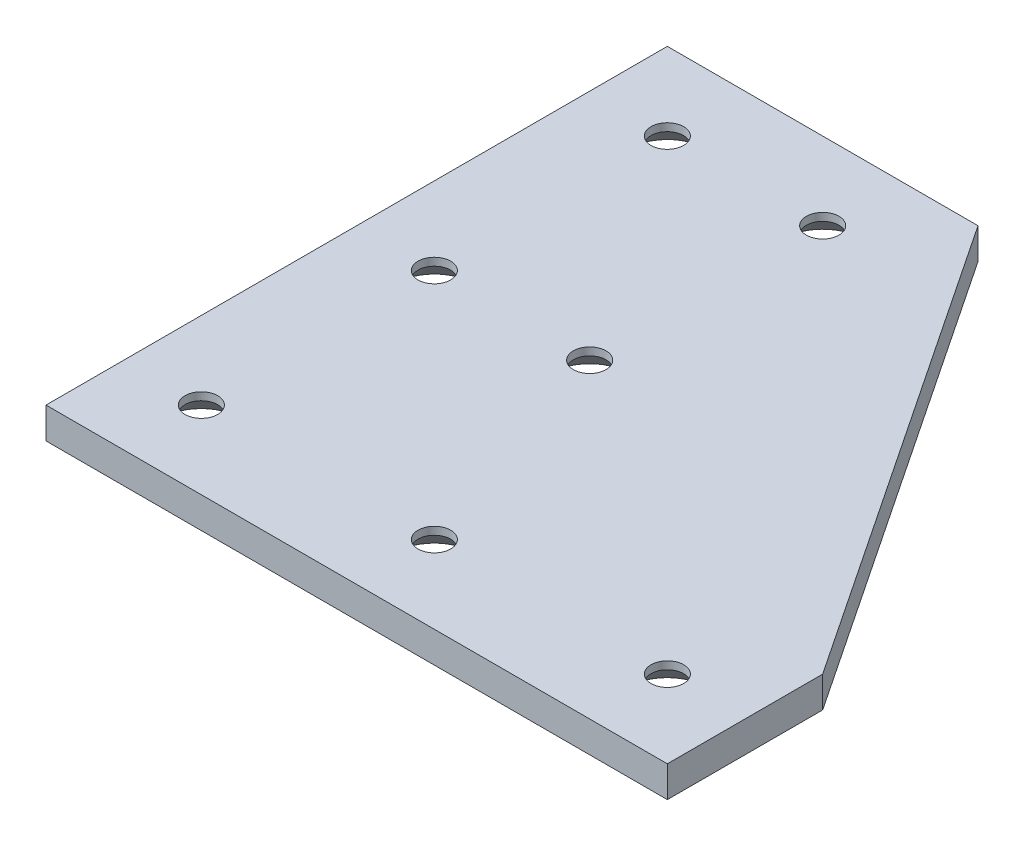
ISO-10303-21;
HEADER;
FILE_DESCRIPTION(('STEP AP214'),'2;1');
FILE_NAME('part.step','',(''),(''),'','','');
FILE_SCHEMA(('AUTOMOTIVE_DESIGN { 1 0 10303 214 1 1 1 1 }'));
ENDSEC;
DATA;
#1=APPLICATION_CONTEXT('core data for automotive mechanical design processes');
#2=APPLICATION_PROTOCOL_DEFINITION('international standard','automotive_design',2000,#1);
#3=PRODUCT_CONTEXT('',#1,'mechanical');
#4=PRODUCT('Part','Part','',(#3));
#5=PRODUCT_RELATED_PRODUCT_CATEGORY('part','',(#4));
#6=PRODUCT_DEFINITION_FORMATION('','',#4);
#7=PRODUCT_DEFINITION_CONTEXT('part definition',#1,'design');
#8=PRODUCT_DEFINITION('design','',#6,#7);
#9=PRODUCT_DEFINITION_SHAPE('','',#8);
#10=(LENGTH_UNIT() NAMED_UNIT(*) SI_UNIT(.MILLI.,.METRE.));
#11=(NAMED_UNIT(*) PLANE_ANGLE_UNIT() SI_UNIT($,.RADIAN.));
#12=(NAMED_UNIT(*) SI_UNIT($,.STERADIAN.) SOLID_ANGLE_UNIT());
#13=UNCERTAINTY_MEASURE_WITH_UNIT(LENGTH_MEASURE(1.E-05),#10,'distance_accuracy_value','');
#14=(GEOMETRIC_REPRESENTATION_CONTEXT(3) GLOBAL_UNCERTAINTY_ASSIGNED_CONTEXT((#13)) GLOBAL_UNIT_ASSIGNED_CONTEXT((#10,
#11,#12)) REPRESENTATION_CONTEXT('',''));
#15=CARTESIAN_POINT('',(0.,0.,0.));
#16=DIRECTION('',(0.,0.,1.));
#17=DIRECTION('',(1.,0.,0.));
#18=AXIS2_PLACEMENT_3D('',#15,#16,#17);
#19=CARTESIAN_POINT('',(0.,4.,-80.));
#20=DIRECTION('',(1.,0.,0.));
#21=DIRECTION('',(0.,0.,-1.));
#22=AXIS2_PLACEMENT_3D('',#19,#20,#21);
#23=PLANE('',#22);
#24=DIRECTION('',(0.,0.,1.));
#25=VECTOR('',#24,1.);
#26=CARTESIAN_POINT('',(0.,0.,-80.));
#27=LINE('',#26,#25);
#28=CARTESIAN_POINT('',(0.,0.,-80.));
#29=VERTEX_POINT('',#28);
#30=CARTESIAN_POINT('',(0.,0.,0.));
#31=VERTEX_POINT('',#30);
#32=EDGE_CURVE('E128',#29,#31,#27,.T.);
#33=ORIENTED_EDGE('',*,*,#32,.T.);
#34=DIRECTION('',(0.,-1.,0.));
#35=VECTOR('',#34,1.);
#36=CARTESIAN_POINT('',(0.,4.,0.));
#37=LINE('',#36,#35);
#38=CARTESIAN_POINT('',(0.,4.,0.));
#39=VERTEX_POINT('',#38);
#40=EDGE_CURVE('E149',#39,#31,#37,.T.);
#41=ORIENTED_EDGE('',*,*,#40,.F.);
#42=DIRECTION('',(0.,0.,1.));
#43=VECTOR('',#42,1.);
#44=CARTESIAN_POINT('',(0.,4.,-80.));
#45=LINE('',#44,#43);
#46=CARTESIAN_POINT('',(0.,4.,-80.));
#47=VERTEX_POINT('',#46);
#48=EDGE_CURVE('E142',#47,#39,#45,.T.);
#49=ORIENTED_EDGE('',*,*,#48,.F.);
#50=DIRECTION('',(0.,-1.,0.));
#51=VECTOR('',#50,1.);
#52=CARTESIAN_POINT('',(0.,4.,-80.));
#53=LINE('',#52,#51);
#54=EDGE_CURVE('E124',#47,#29,#53,.T.);
#55=ORIENTED_EDGE('',*,*,#54,.T.);
#56=EDGE_LOOP('',(#33,#41,#49,#55));
#57=FACE_BOUND('',#56,.T.);
#58=ADVANCED_FACE('F45',(#57),#23,.F.);
#59=CARTESIAN_POINT('',(0.,4.,0.));
#60=DIRECTION('',(0.,0.,-1.));
#61=DIRECTION('',(-1.,0.,0.));
#62=AXIS2_PLACEMENT_3D('',#59,#60,#61);
#63=PLANE('',#62);
#64=DIRECTION('',(1.,0.,0.));
#65=VECTOR('',#64,1.);
#66=CARTESIAN_POINT('',(0.,0.,0.));
#67=LINE('',#66,#65);
#68=CARTESIAN_POINT('',(80.,0.,0.));
#69=VERTEX_POINT('',#68);
#70=EDGE_CURVE('E132',#31,#69,#67,.T.);
#71=ORIENTED_EDGE('',*,*,#70,.T.);
#72=DIRECTION('',(0.,-1.,0.));
#73=VECTOR('',#72,1.);
#74=CARTESIAN_POINT('',(80.,4.,0.));
#75=LINE('',#74,#73);
#76=CARTESIAN_POINT('',(80.,4.,0.));
#77=VERTEX_POINT('',#76);
#78=EDGE_CURVE('E117',#77,#69,#75,.T.);
#79=ORIENTED_EDGE('',*,*,#78,.F.);
#80=DIRECTION('',(1.,0.,0.));
#81=VECTOR('',#80,1.);
#82=CARTESIAN_POINT('',(0.,4.,0.));
#83=LINE('',#82,#81);
#84=EDGE_CURVE('E99',#39,#77,#83,.T.);
#85=ORIENTED_EDGE('',*,*,#84,.F.);
#86=ORIENTED_EDGE('',*,*,#40,.T.);
#87=EDGE_LOOP('',(#71,#79,#85,#86));
#88=FACE_BOUND('',#87,.T.);
#89=ADVANCED_FACE('F235',(#88),#63,.F.);
#90=CARTESIAN_POINT('',(80.,4.,0.));
#91=DIRECTION('',(-1.,0.,0.));
#92=DIRECTION('',(0.,0.,1.));
#93=AXIS2_PLACEMENT_3D('',#90,#91,#92);
#94=PLANE('',#93);
#95=DIRECTION('',(0.,0.,-1.));
#96=VECTOR('',#95,1.);
#97=CARTESIAN_POINT('',(80.,0.,0.));
#98=LINE('',#97,#96);
#99=CARTESIAN_POINT('',(80.,0.,-20.));
#100=VERTEX_POINT('',#99);
#101=EDGE_CURVE('E115',#69,#100,#98,.T.);
#102=ORIENTED_EDGE('',*,*,#101,.T.);
#103=DIRECTION('',(0.,-1.,0.));
#104=VECTOR('',#103,1.);
#105=CARTESIAN_POINT('',(80.,4.,-20.));
#106=LINE('',#105,#104);
#107=CARTESIAN_POINT('',(80.,4.,-20.));
#108=VERTEX_POINT('',#107);
#109=EDGE_CURVE('E112',#108,#100,#106,.T.);
#110=ORIENTED_EDGE('',*,*,#109,.F.);
#111=DIRECTION('',(0.,0.,-1.));
#112=VECTOR('',#111,1.);
#113=CARTESIAN_POINT('',(80.,4.,0.));
#114=LINE('',#113,#112);
#115=EDGE_CURVE('E103',#77,#108,#114,.T.);
#116=ORIENTED_EDGE('',*,*,#115,.F.);
#117=ORIENTED_EDGE('',*,*,#78,.T.);
#118=EDGE_LOOP('',(#102,#110,#116,#117));
#119=FACE_BOUND('',#118,.T.);
#120=ADVANCED_FACE('F113',(#119),#94,.F.);
#121=CARTESIAN_POINT('',(80.,4.,-20.));
#122=DIRECTION('',(-0.832050294337844,0.,0.554700196225229));
#123=DIRECTION('',(0.554700196225229,0.,0.832050294337844));
#124=AXIS2_PLACEMENT_3D('',#121,#122,#123);
#125=PLANE('',#124);
#126=DIRECTION('',(-0.554700196225229,0.,-0.832050294337844));
#127=VECTOR('',#126,1.);
#128=CARTESIAN_POINT('',(80.,0.,-20.));
#129=LINE('',#128,#127);
#130=CARTESIAN_POINT('',(40.,0.,-80.));
#131=VERTEX_POINT('',#130);
#132=EDGE_CURVE('E84',#100,#131,#129,.T.);
#133=ORIENTED_EDGE('',*,*,#132,.T.);
#134=DIRECTION('',(0.,-1.,0.));
#135=VECTOR('',#134,1.);
#136=CARTESIAN_POINT('',(40.,4.,-80.));
#137=LINE('',#136,#135);
#138=CARTESIAN_POINT('',(40.,4.,-80.));
#139=VERTEX_POINT('',#138);
#140=EDGE_CURVE('E118',#139,#131,#137,.T.);
#141=ORIENTED_EDGE('',*,*,#140,.F.);
#142=DIRECTION('',(-0.554700196225229,0.,-0.832050294337844));
#143=VECTOR('',#142,1.);
#144=CARTESIAN_POINT('',(80.,4.,-20.));
#145=LINE('',#144,#143);
#146=EDGE_CURVE('E107',#108,#139,#145,.T.);
#147=ORIENTED_EDGE('',*,*,#146,.F.);
#148=ORIENTED_EDGE('',*,*,#109,.T.);
#149=EDGE_LOOP('',(#133,#141,#147,#148));
#150=FACE_BOUND('',#149,.T.);
#151=ADVANCED_FACE('F120',(#150),#125,.F.);
#152=CARTESIAN_POINT('',(40.,4.,-80.));
#153=DIRECTION('',(0.,0.,1.));
#154=DIRECTION('',(1.,0.,0.));
#155=AXIS2_PLACEMENT_3D('',#152,#153,#154);
#156=PLANE('',#155);
#157=DIRECTION('',(-1.,0.,0.));
#158=VECTOR('',#157,1.);
#159=CARTESIAN_POINT('',(40.,0.,-80.));
#160=LINE('',#159,#158);
#161=EDGE_CURVE('E90',#131,#29,#160,.T.);
#162=ORIENTED_EDGE('',*,*,#161,.T.);
#163=ORIENTED_EDGE('',*,*,#54,.F.);
#164=DIRECTION('',(-1.,0.,0.));
#165=VECTOR('',#164,1.);
#166=CARTESIAN_POINT('',(40.,4.,-80.));
#167=LINE('',#166,#165);
#168=EDGE_CURVE('E64',#139,#47,#167,.T.);
#169=ORIENTED_EDGE('',*,*,#168,.F.);
#170=ORIENTED_EDGE('',*,*,#140,.T.);
#171=EDGE_LOOP('',(#162,#163,#169,#170));
#172=FACE_BOUND('',#171,.T.);
#173=ADVANCED_FACE('F224',(#172),#156,.F.);
#174=CARTESIAN_POINT('',(0.,4.,0.));
#175=DIRECTION('',(0.,1.,0.));
#176=DIRECTION('',(0.,0.,1.));
#177=AXIS2_PLACEMENT_3D('',#174,#175,#176);
#178=PLANE('',#177);
#179=CARTESIAN_POINT('',(9.99999999999979,4.,-70.));
#180=DIRECTION('',(0.,1.,0.));
#181=DIRECTION('',(0.,0.,1.));
#182=AXIS2_PLACEMENT_3D('',#179,#180,#181);
#183=CIRCLE('',#182,2.1);
#184=CARTESIAN_POINT('',(9.99999999999979,4.,-67.9));
#185=VERTEX_POINT('',#184);
#186=EDGE_CURVE('E304',#185,#185,#183,.T.);
#187=ORIENTED_EDGE('',*,*,#186,.F.);
#188=EDGE_LOOP('',(#187));
#189=FACE_BOUND('',#188,.T.);
#190=CARTESIAN_POINT('',(9.9999999999999,4.,-40.));
#191=DIRECTION('',(0.,1.,0.));
#192=DIRECTION('',(0.,0.,1.));
#193=AXIS2_PLACEMENT_3D('',#190,#191,#192);
#194=CIRCLE('',#193,2.1);
#195=CARTESIAN_POINT('',(9.9999999999999,4.,-37.9));
#196=VERTEX_POINT('',#195);
#197=EDGE_CURVE('E310',#196,#196,#194,.T.);
#198=ORIENTED_EDGE('',*,*,#197,.F.);
#199=EDGE_LOOP('',(#198));
#200=FACE_BOUND('',#199,.T.);
#201=CARTESIAN_POINT('',(29.9999999999998,4.,-70.));
#202=DIRECTION('',(0.,1.,0.));
#203=DIRECTION('',(0.,0.,1.));
#204=AXIS2_PLACEMENT_3D('',#201,#202,#203);
#205=CIRCLE('',#204,2.1);
#206=CARTESIAN_POINT('',(29.9999999999998,4.,-67.9));
#207=VERTEX_POINT('',#206);
#208=EDGE_CURVE('E314',#207,#207,#205,.T.);
#209=ORIENTED_EDGE('',*,*,#208,.F.);
#210=EDGE_LOOP('',(#209));
#211=FACE_BOUND('',#210,.T.);
#212=CARTESIAN_POINT('',(29.9999999999999,4.,-40.));
#213=DIRECTION('',(0.,1.,0.));
#214=DIRECTION('',(0.,0.,1.));
#215=AXIS2_PLACEMENT_3D('',#212,#213,#214);
#216=CIRCLE('',#215,2.1);
#217=CARTESIAN_POINT('',(29.9999999999999,4.,-37.9));
#218=VERTEX_POINT('',#217);
#219=EDGE_CURVE('E318',#218,#218,#216,.T.);
#220=ORIENTED_EDGE('',*,*,#219,.F.);
#221=EDGE_LOOP('',(#220));
#222=FACE_BOUND('',#221,.T.);
#223=CARTESIAN_POINT('',(70.,4.,-9.99999999999999));
#224=DIRECTION('',(0.,1.,0.));
#225=DIRECTION('',(0.,0.,1.));
#226=AXIS2_PLACEMENT_3D('',#223,#224,#225);
#227=CIRCLE('',#226,2.1);
#228=CARTESIAN_POINT('',(70.,4.,-7.89999999999999));
#229=VERTEX_POINT('',#228);
#230=EDGE_CURVE('E300',#229,#229,#227,.T.);
#231=ORIENTED_EDGE('',*,*,#230,.F.);
#232=EDGE_LOOP('',(#231));
#233=FACE_BOUND('',#232,.T.);
#234=CARTESIAN_POINT('',(40.,4.,-9.99999999999999));
#235=DIRECTION('',(0.,1.,0.));
#236=DIRECTION('',(0.,0.,1.));
#237=AXIS2_PLACEMENT_3D('',#234,#235,#236);
#238=CIRCLE('',#237,2.1);
#239=CARTESIAN_POINT('',(40.,4.,-7.9));
#240=VERTEX_POINT('',#239);
#241=EDGE_CURVE('E296',#240,#240,#238,.T.);
#242=ORIENTED_EDGE('',*,*,#241,.F.);
#243=EDGE_LOOP('',(#242));
#244=FACE_BOUND('',#243,.T.);
#245=CARTESIAN_POINT('',(10.,4.,-9.99999999999999));
#246=DIRECTION('',(0.,1.,0.));
#247=DIRECTION('',(0.,0.,1.));
#248=AXIS2_PLACEMENT_3D('',#245,#246,#247);
#249=CIRCLE('',#248,2.1);
#250=CARTESIAN_POINT('',(10.,4.,-7.89999999999999));
#251=VERTEX_POINT('',#250);
#252=EDGE_CURVE('E133',#251,#251,#249,.T.);
#253=ORIENTED_EDGE('',*,*,#252,.F.);
#254=EDGE_LOOP('',(#253));
#255=FACE_BOUND('',#254,.T.);
#256=ORIENTED_EDGE('',*,*,#48,.T.);
#257=ORIENTED_EDGE('',*,*,#84,.T.);
#258=ORIENTED_EDGE('',*,*,#115,.T.);
#259=ORIENTED_EDGE('',*,*,#146,.T.);
#260=ORIENTED_EDGE('',*,*,#168,.T.);
#261=EDGE_LOOP('',(#256,#257,#258,#259,#260));
#262=FACE_BOUND('',#261,.T.);
#263=ADVANCED_FACE('F105',(#189,#200,#211,#222,#233,#244,#255,#262),#178,.T.);
#264=CARTESIAN_POINT('',(0.,0.,0.));
#265=DIRECTION('',(0.,1.,0.));
#266=DIRECTION('',(0.,0.,1.));
#267=AXIS2_PLACEMENT_3D('',#264,#265,#266);
#268=PLANE('',#267);
#269=CARTESIAN_POINT('',(9.99999999999979,0.,-70.));
#270=DIRECTION('',(0.,1.,0.));
#271=DIRECTION('',(0.,0.,1.));
#272=AXIS2_PLACEMENT_3D('',#269,#270,#271);
#273=CIRCLE('',#272,5.09999999999998);
#274=CARTESIAN_POINT('',(9.99999999999979,0.,-64.9));
#275=VERTEX_POINT('',#274);
#276=EDGE_CURVE('E176',#275,#275,#273,.T.);
#277=ORIENTED_EDGE('',*,*,#276,.T.);
#278=EDGE_LOOP('',(#277));
#279=FACE_BOUND('',#278,.T.);
#280=CARTESIAN_POINT('',(29.9999999999998,0.,-70.));
#281=DIRECTION('',(0.,1.,0.));
#282=DIRECTION('',(0.,0.,1.));
#283=AXIS2_PLACEMENT_3D('',#280,#281,#282);
#284=CIRCLE('',#283,5.09999999999999);
#285=CARTESIAN_POINT('',(29.9999999999998,0.,-64.9));
#286=VERTEX_POINT('',#285);
#287=EDGE_CURVE('E172',#286,#286,#284,.T.);
#288=ORIENTED_EDGE('',*,*,#287,.T.);
#289=EDGE_LOOP('',(#288));
#290=FACE_BOUND('',#289,.T.);
#291=CARTESIAN_POINT('',(29.9999999999999,0.,-40.));
#292=DIRECTION('',(0.,1.,0.));
#293=DIRECTION('',(0.,0.,1.));
#294=AXIS2_PLACEMENT_3D('',#291,#292,#293);
#295=CIRCLE('',#294,5.09999999999998);
#296=CARTESIAN_POINT('',(29.9999999999999,0.,-34.9));
#297=VERTEX_POINT('',#296);
#298=EDGE_CURVE('E168',#297,#297,#295,.T.);
#299=ORIENTED_EDGE('',*,*,#298,.T.);
#300=EDGE_LOOP('',(#299));
#301=FACE_BOUND('',#300,.T.);
#302=CARTESIAN_POINT('',(9.9999999999999,0.,-40.));
#303=DIRECTION('',(0.,1.,0.));
#304=DIRECTION('',(0.,0.,1.));
#305=AXIS2_PLACEMENT_3D('',#302,#303,#304);
#306=CIRCLE('',#305,5.09999999999998);
#307=CARTESIAN_POINT('',(9.9999999999999,0.,-34.9));
#308=VERTEX_POINT('',#307);
#309=EDGE_CURVE('E164',#308,#308,#306,.T.);
#310=ORIENTED_EDGE('',*,*,#309,.T.);
#311=EDGE_LOOP('',(#310));
#312=FACE_BOUND('',#311,.T.);
#313=CARTESIAN_POINT('',(10.,0.,-9.99999999999999));
#314=DIRECTION('',(0.,1.,0.));
#315=DIRECTION('',(0.,0.,1.));
#316=AXIS2_PLACEMENT_3D('',#313,#314,#315);
#317=CIRCLE('',#316,5.10000000000001);
#318=CARTESIAN_POINT('',(10.,0.,-4.89999999999999));
#319=VERTEX_POINT('',#318);
#320=EDGE_CURVE('E160',#319,#319,#317,.T.);
#321=ORIENTED_EDGE('',*,*,#320,.T.);
#322=EDGE_LOOP('',(#321));
#323=FACE_BOUND('',#322,.T.);
#324=CARTESIAN_POINT('',(40.,0.,-9.99999999999999));
#325=DIRECTION('',(0.,1.,0.));
#326=DIRECTION('',(0.,0.,1.));
#327=AXIS2_PLACEMENT_3D('',#324,#325,#326);
#328=CIRCLE('',#327,5.09999999999999);
#329=CARTESIAN_POINT('',(40.,0.,-4.9));
#330=VERTEX_POINT('',#329);
#331=EDGE_CURVE('E156',#330,#330,#328,.T.);
#332=ORIENTED_EDGE('',*,*,#331,.T.);
#333=EDGE_LOOP('',(#332));
#334=FACE_BOUND('',#333,.T.);
#335=CARTESIAN_POINT('',(70.,0.,-9.99999999999999));
#336=DIRECTION('',(0.,1.,0.));
#337=DIRECTION('',(0.,0.,1.));
#338=AXIS2_PLACEMENT_3D('',#335,#336,#337);
#339=CIRCLE('',#338,5.10000000000001);
#340=CARTESIAN_POINT('',(70.,0.,-4.89999999999999));
#341=VERTEX_POINT('',#340);
#342=EDGE_CURVE('E152',#341,#341,#339,.T.);
#343=ORIENTED_EDGE('',*,*,#342,.T.);
#344=EDGE_LOOP('',(#343));
#345=FACE_BOUND('',#344,.T.);
#346=ORIENTED_EDGE('',*,*,#32,.F.);
#347=ORIENTED_EDGE('',*,*,#161,.F.);
#348=ORIENTED_EDGE('',*,*,#132,.F.);
#349=ORIENTED_EDGE('',*,*,#101,.F.);
#350=ORIENTED_EDGE('',*,*,#70,.F.);
#351=EDGE_LOOP('',(#346,#347,#348,#349,#350));
#352=FACE_BOUND('',#351,.T.);
#353=ADVANCED_FACE('F212',(#279,#290,#301,#312,#323,#334,#345,#352),#268,.F.);
#354=CARTESIAN_POINT('',(10.,0.,-9.99999999999999));
#355=DIRECTION('',(0.,1.,0.));
#356=DIRECTION('',(0.,0.,1.));
#357=AXIS2_PLACEMENT_3D('',#354,#355,#356);
#358=CYLINDRICAL_SURFACE('',#357,2.1);
#359=CARTESIAN_POINT('',(10.,3.00000000000003,-9.99999999999999));
#360=DIRECTION('',(0.,1.,0.));
#361=DIRECTION('',(0.,0.,1.));
#362=AXIS2_PLACEMENT_3D('',#359,#360,#361);
#363=CIRCLE('',#362,2.1);
#364=CARTESIAN_POINT('',(10.,3.00000000000003,-7.89999999999999));
#365=VERTEX_POINT('',#364);
#366=EDGE_CURVE('E196',#365,#365,#363,.F.);
#367=ORIENTED_EDGE('',*,*,#366,.T.);
#368=EDGE_LOOP('',(#367));
#369=FACE_BOUND('',#368,.T.);
#370=ORIENTED_EDGE('',*,*,#252,.T.);
#371=EDGE_LOOP('',(#370));
#372=FACE_BOUND('',#371,.T.);
#373=ADVANCED_FACE('F215',(#369,#372),#358,.F.);
#374=CARTESIAN_POINT('',(40.,0.,-9.99999999999999));
#375=DIRECTION('',(0.,1.,0.));
#376=DIRECTION('',(0.,0.,1.));
#377=AXIS2_PLACEMENT_3D('',#374,#375,#376);
#378=CYLINDRICAL_SURFACE('',#377,2.1);
#379=CARTESIAN_POINT('',(40.,3.00000000000002,-9.99999999999999));
#380=DIRECTION('',(0.,1.,0.));
#381=DIRECTION('',(0.,0.,1.));
#382=AXIS2_PLACEMENT_3D('',#379,#380,#381);
#383=CIRCLE('',#382,2.1);
#384=CARTESIAN_POINT('',(40.,3.00000000000002,-7.9));
#385=VERTEX_POINT('',#384);
#386=EDGE_CURVE('E56',#385,#385,#383,.F.);
#387=ORIENTED_EDGE('',*,*,#386,.T.);
#388=EDGE_LOOP('',(#387));
#389=FACE_BOUND('',#388,.T.);
#390=ORIENTED_EDGE('',*,*,#241,.T.);
#391=EDGE_LOOP('',(#390));
#392=FACE_BOUND('',#391,.T.);
#393=ADVANCED_FACE('F203',(#389,#392),#378,.F.);
#394=CARTESIAN_POINT('',(70.,0.,-9.99999999999999));
#395=DIRECTION('',(0.,1.,0.));
#396=DIRECTION('',(0.,0.,1.));
#397=AXIS2_PLACEMENT_3D('',#394,#395,#396);
#398=CYLINDRICAL_SURFACE('',#397,2.1);
#399=CARTESIAN_POINT('',(70.,3.00000000000002,-9.99999999999999));
#400=DIRECTION('',(0.,1.,0.));
#401=DIRECTION('',(0.,0.,1.));
#402=AXIS2_PLACEMENT_3D('',#399,#400,#401);
#403=CIRCLE('',#402,2.1);
#404=CARTESIAN_POINT('',(70.,3.00000000000002,-7.89999999999999));
#405=VERTEX_POINT('',#404);
#406=EDGE_CURVE('E11',#405,#405,#403,.F.);
#407=ORIENTED_EDGE('',*,*,#406,.T.);
#408=EDGE_LOOP('',(#407));
#409=FACE_BOUND('',#408,.T.);
#410=ORIENTED_EDGE('',*,*,#230,.T.);
#411=EDGE_LOOP('',(#410));
#412=FACE_BOUND('',#411,.T.);
#413=ADVANCED_FACE('F326',(#409,#412),#398,.F.);
#414=CARTESIAN_POINT('',(29.9999999999999,0.,-40.));
#415=DIRECTION('',(0.,1.,0.));
#416=DIRECTION('',(0.,0.,1.));
#417=AXIS2_PLACEMENT_3D('',#414,#415,#416);
#418=CYLINDRICAL_SURFACE('',#417,2.1);
#419=CARTESIAN_POINT('',(29.9999999999999,2.99999999999999,-40.));
#420=DIRECTION('',(0.,1.,0.));
#421=DIRECTION('',(0.,0.,1.));
#422=AXIS2_PLACEMENT_3D('',#419,#420,#421);
#423=CIRCLE('',#422,2.1);
#424=CARTESIAN_POINT('',(29.9999999999999,2.99999999999999,-37.9));
#425=VERTEX_POINT('',#424);
#426=EDGE_CURVE('E188',#425,#425,#423,.F.);
#427=ORIENTED_EDGE('',*,*,#426,.T.);
#428=EDGE_LOOP('',(#427));
#429=FACE_BOUND('',#428,.T.);
#430=ORIENTED_EDGE('',*,*,#219,.T.);
#431=EDGE_LOOP('',(#430));
#432=FACE_BOUND('',#431,.T.);
#433=ADVANCED_FACE('F335',(#429,#432),#418,.F.);
#434=CARTESIAN_POINT('',(29.9999999999998,0.,-70.));
#435=DIRECTION('',(0.,1.,0.));
#436=DIRECTION('',(0.,0.,1.));
#437=AXIS2_PLACEMENT_3D('',#434,#435,#436);
#438=CYLINDRICAL_SURFACE('',#437,2.1);
#439=CARTESIAN_POINT('',(29.9999999999998,3.00000000000001,-70.));
#440=DIRECTION('',(0.,1.,0.));
#441=DIRECTION('',(0.,0.,1.));
#442=AXIS2_PLACEMENT_3D('',#439,#440,#441);
#443=CIRCLE('',#442,2.1);
#444=CARTESIAN_POINT('',(29.9999999999998,3.00000000000001,-67.9));
#445=VERTEX_POINT('',#444);
#446=EDGE_CURVE('E184',#445,#445,#443,.F.);
#447=ORIENTED_EDGE('',*,*,#446,.T.);
#448=EDGE_LOOP('',(#447));
#449=FACE_BOUND('',#448,.T.);
#450=ORIENTED_EDGE('',*,*,#208,.T.);
#451=EDGE_LOOP('',(#450));
#452=FACE_BOUND('',#451,.T.);
#453=ADVANCED_FACE('F341',(#449,#452),#438,.F.);
#454=CARTESIAN_POINT('',(9.9999999999999,0.,-40.));
#455=DIRECTION('',(0.,1.,0.));
#456=DIRECTION('',(0.,0.,1.));
#457=AXIS2_PLACEMENT_3D('',#454,#455,#456);
#458=CYLINDRICAL_SURFACE('',#457,2.1);
#459=CARTESIAN_POINT('',(9.9999999999999,2.99999999999999,-40.));
#460=DIRECTION('',(0.,1.,0.));
#461=DIRECTION('',(0.,0.,1.));
#462=AXIS2_PLACEMENT_3D('',#459,#460,#461);
#463=CIRCLE('',#462,2.1);
#464=CARTESIAN_POINT('',(9.9999999999999,2.99999999999999,-37.9));
#465=VERTEX_POINT('',#464);
#466=EDGE_CURVE('E192',#465,#465,#463,.F.);
#467=ORIENTED_EDGE('',*,*,#466,.T.);
#468=EDGE_LOOP('',(#467));
#469=FACE_BOUND('',#468,.T.);
#470=ORIENTED_EDGE('',*,*,#197,.T.);
#471=EDGE_LOOP('',(#470));
#472=FACE_BOUND('',#471,.T.);
#473=ADVANCED_FACE('F345',(#469,#472),#458,.F.);
#474=CARTESIAN_POINT('',(9.99999999999979,0.,-70.));
#475=DIRECTION('',(0.,1.,0.));
#476=DIRECTION('',(0.,0.,1.));
#477=AXIS2_PLACEMENT_3D('',#474,#475,#476);
#478=CYLINDRICAL_SURFACE('',#477,2.1);
#479=CARTESIAN_POINT('',(9.99999999999979,2.99999999999999,-70.));
#480=DIRECTION('',(0.,1.,0.));
#481=DIRECTION('',(0.,0.,1.));
#482=AXIS2_PLACEMENT_3D('',#479,#480,#481);
#483=CIRCLE('',#482,2.1);
#484=CARTESIAN_POINT('',(9.99999999999979,2.99999999999999,-67.9));
#485=VERTEX_POINT('',#484);
#486=EDGE_CURVE('E180',#485,#485,#483,.F.);
#487=ORIENTED_EDGE('',*,*,#486,.T.);
#488=EDGE_LOOP('',(#487));
#489=FACE_BOUND('',#488,.T.);
#490=ORIENTED_EDGE('',*,*,#186,.T.);
#491=EDGE_LOOP('',(#490));
#492=FACE_BOUND('',#491,.T.);
#493=ADVANCED_FACE('F251',(#489,#492),#478,.F.);
#494=CARTESIAN_POINT('',(9.99999999999979,0.,-70.));
#495=DIRECTION('',(0.,-1.,0.));
#496=DIRECTION('',(0.,0.,-1.));
#497=AXIS2_PLACEMENT_3D('',#494,#495,#496);
#498=CONICAL_SURFACE('',#497,5.09999999999998,0.785398163397446);
#499=ORIENTED_EDGE('',*,*,#486,.F.);
#500=EDGE_LOOP('',(#499));
#501=FACE_BOUND('',#500,.T.);
#502=ORIENTED_EDGE('',*,*,#276,.F.);
#503=EDGE_LOOP('',(#502));
#504=FACE_BOUND('',#503,.T.);
#505=ADVANCED_FACE('F244',(#501,#504),#498,.F.);
#506=CARTESIAN_POINT('',(29.9999999999998,0.,-70.));
#507=DIRECTION('',(0.,-1.,0.));
#508=DIRECTION('',(0.,0.,-1.));
#509=AXIS2_PLACEMENT_3D('',#506,#507,#508);
#510=CONICAL_SURFACE('',#509,5.09999999999999,0.785398163397446);
#511=ORIENTED_EDGE('',*,*,#446,.F.);
#512=EDGE_LOOP('',(#511));
#513=FACE_BOUND('',#512,.T.);
#514=ORIENTED_EDGE('',*,*,#287,.F.);
#515=EDGE_LOOP('',(#514));
#516=FACE_BOUND('',#515,.T.);
#517=ADVANCED_FACE('F250',(#513,#516),#510,.F.);
#518=CARTESIAN_POINT('',(29.9999999999999,0.,-40.));
#519=DIRECTION('',(0.,-1.,0.));
#520=DIRECTION('',(0.,0.,-1.));
#521=AXIS2_PLACEMENT_3D('',#518,#519,#520);
#522=CONICAL_SURFACE('',#521,5.09999999999998,0.785398163397446);
#523=ORIENTED_EDGE('',*,*,#426,.F.);
#524=EDGE_LOOP('',(#523));
#525=FACE_BOUND('',#524,.T.);
#526=ORIENTED_EDGE('',*,*,#298,.F.);
#527=EDGE_LOOP('',(#526));
#528=FACE_BOUND('',#527,.T.);
#529=ADVANCED_FACE('F258',(#525,#528),#522,.F.);
#530=CARTESIAN_POINT('',(9.9999999999999,0.,-40.));
#531=DIRECTION('',(0.,-1.,0.));
#532=DIRECTION('',(0.,0.,-1.));
#533=AXIS2_PLACEMENT_3D('',#530,#531,#532);
#534=CONICAL_SURFACE('',#533,5.09999999999998,0.785398163397446);
#535=ORIENTED_EDGE('',*,*,#466,.F.);
#536=EDGE_LOOP('',(#535));
#537=FACE_BOUND('',#536,.T.);
#538=ORIENTED_EDGE('',*,*,#309,.F.);
#539=EDGE_LOOP('',(#538));
#540=FACE_BOUND('',#539,.T.);
#541=ADVANCED_FACE('F265',(#537,#540),#534,.F.);
#542=CARTESIAN_POINT('',(10.,0.,-9.99999999999999));
#543=DIRECTION('',(0.,-1.,0.));
#544=DIRECTION('',(0.,0.,-1.));
#545=AXIS2_PLACEMENT_3D('',#542,#543,#544);
#546=CONICAL_SURFACE('',#545,5.10000000000001,0.785398163397445);
#547=ORIENTED_EDGE('',*,*,#366,.F.);
#548=EDGE_LOOP('',(#547));
#549=FACE_BOUND('',#548,.T.);
#550=ORIENTED_EDGE('',*,*,#320,.F.);
#551=EDGE_LOOP('',(#550));
#552=FACE_BOUND('',#551,.T.);
#553=ADVANCED_FACE('F209',(#549,#552),#546,.F.);
#554=CARTESIAN_POINT('',(40.,0.,-9.99999999999999));
#555=DIRECTION('',(0.,-1.,0.));
#556=DIRECTION('',(0.,0.,-1.));
#557=AXIS2_PLACEMENT_3D('',#554,#555,#556);
#558=CONICAL_SURFACE('',#557,5.09999999999999,0.785398163397445);
#559=ORIENTED_EDGE('',*,*,#386,.F.);
#560=EDGE_LOOP('',(#559));
#561=FACE_BOUND('',#560,.T.);
#562=ORIENTED_EDGE('',*,*,#331,.F.);
#563=EDGE_LOOP('',(#562));
#564=FACE_BOUND('',#563,.T.);
#565=ADVANCED_FACE('F206',(#561,#564),#558,.F.);
#566=CARTESIAN_POINT('',(70.,0.,-9.99999999999999));
#567=DIRECTION('',(0.,-1.,0.));
#568=DIRECTION('',(0.,0.,-1.));
#569=AXIS2_PLACEMENT_3D('',#566,#567,#568);
#570=CONICAL_SURFACE('',#569,5.10000000000001,0.785398163397445);
#571=ORIENTED_EDGE('',*,*,#406,.F.);
#572=EDGE_LOOP('',(#571));
#573=FACE_BOUND('',#572,.T.);
#574=ORIENTED_EDGE('',*,*,#342,.F.);
#575=EDGE_LOOP('',(#574));
#576=FACE_BOUND('',#575,.T.);
#577=ADVANCED_FACE('F48',(#573,#576),#570,.F.);
#578=CLOSED_SHELL('',(#58,#89,#120,#151,#173,#263,#353,#373,#393,#413,#433,#453,#473,#493,#505,
#517,#529,#541,#553,#565,#577));
#579=MANIFOLD_SOLID_BREP('B2',#578);
#580=ADVANCED_BREP_SHAPE_REPRESENTATION('',(#18,#579),#14);
#581=SHAPE_DEFINITION_REPRESENTATION(#9,#580);
ENDSEC;
END-ISO-10303-21;
